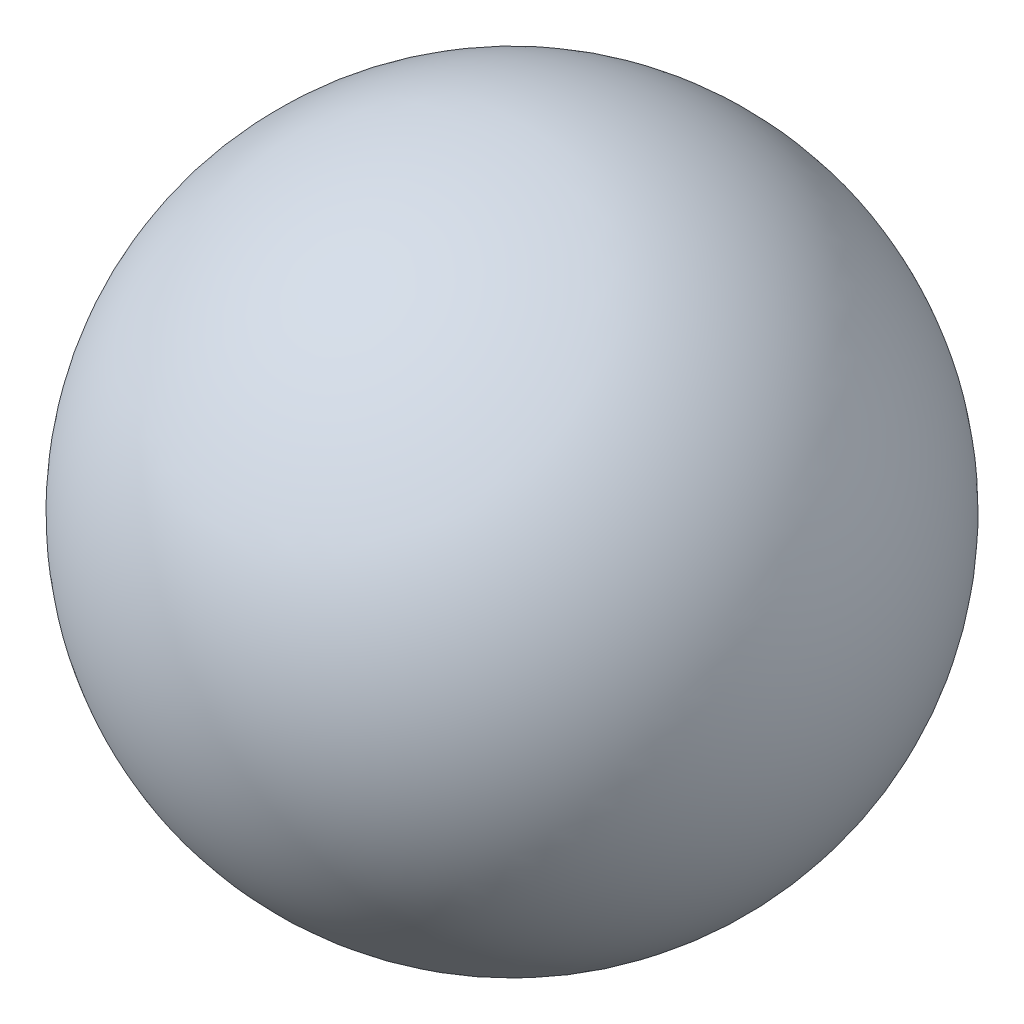
ISO-10303-21;
HEADER;
FILE_DESCRIPTION(('STEP AP214'),'2;1');
FILE_NAME('part.step','',(''),(''),'','','');
FILE_SCHEMA(('AUTOMOTIVE_DESIGN { 1 0 10303 214 1 1 1 1 }'));
ENDSEC;
DATA;
#1=APPLICATION_CONTEXT('core data for automotive mechanical design processes');
#2=APPLICATION_PROTOCOL_DEFINITION('international standard','automotive_design',2000,#1);
#3=PRODUCT_CONTEXT('',#1,'mechanical');
#4=PRODUCT('Part','Part','',(#3));
#5=PRODUCT_RELATED_PRODUCT_CATEGORY('part','',(#4));
#6=PRODUCT_DEFINITION_FORMATION('','',#4);
#7=PRODUCT_DEFINITION_CONTEXT('part definition',#1,'design');
#8=PRODUCT_DEFINITION('design','',#6,#7);
#9=PRODUCT_DEFINITION_SHAPE('','',#8);
#10=(LENGTH_UNIT() NAMED_UNIT(*) SI_UNIT(.MILLI.,.METRE.));
#11=(NAMED_UNIT(*) PLANE_ANGLE_UNIT() SI_UNIT($,.RADIAN.));
#12=(NAMED_UNIT(*) SI_UNIT($,.STERADIAN.) SOLID_ANGLE_UNIT());
#13=UNCERTAINTY_MEASURE_WITH_UNIT(LENGTH_MEASURE(1.E-05),#10,'distance_accuracy_value','');
#14=(GEOMETRIC_REPRESENTATION_CONTEXT(3) GLOBAL_UNCERTAINTY_ASSIGNED_CONTEXT((#13)) GLOBAL_UNIT_ASSIGNED_CONTEXT((#10,
#11,#12)) REPRESENTATION_CONTEXT('',''));
#15=CARTESIAN_POINT('',(0.,0.,0.));
#16=DIRECTION('',(0.,0.,1.));
#17=DIRECTION('',(1.,0.,0.));
#18=AXIS2_PLACEMENT_3D('',#15,#16,#17);
#19=CARTESIAN_POINT('',(-3.3103575428868,-2.,-11.2740424399703));
#20=DIRECTION('',(0.,0.,1.));
#21=DIRECTION('',(1.,0.,0.));
#22=AXIS2_PLACEMENT_3D('',#19,#20,#21);
#23=SPHERICAL_SURFACE('',#22,1.05);
#24=CARTESIAN_POINT('',(-3.3103575428868,-2.,-10.2240424399703));
#25=VERTEX_POINT('',#24);
#26=VERTEX_LOOP('',#25);
#27=FACE_BOUND('',#26,.T.);
#28=ADVANCED_FACE('F13',(#27),#23,.T.);
#29=CLOSED_SHELL('',(#28));
#30=MANIFOLD_SOLID_BREP('B1',#29);
#31=ADVANCED_BREP_SHAPE_REPRESENTATION('',(#18,#30),#14);
#32=SHAPE_DEFINITION_REPRESENTATION(#9,#31);
ENDSEC;
END-ISO-10303-21;
